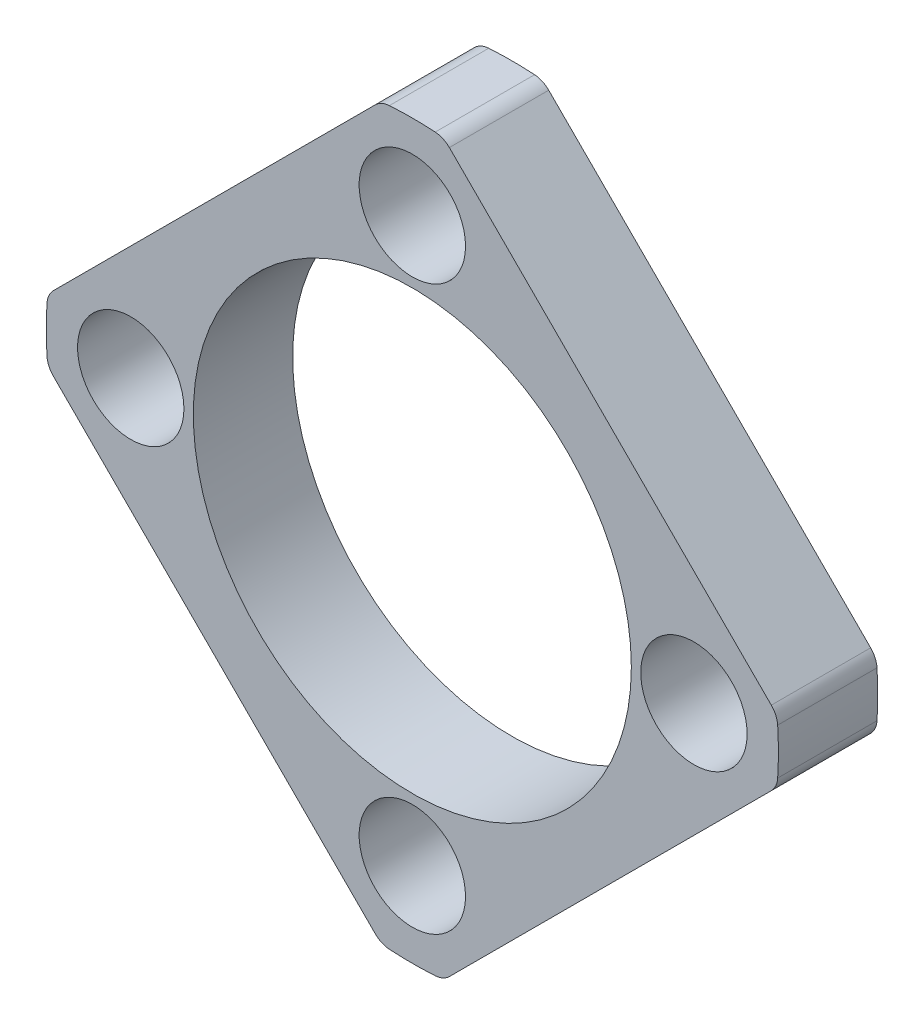
ISO-10303-21;
HEADER;
FILE_DESCRIPTION(('STEP AP214'),'2;1');
FILE_NAME('part.step','',(''),(''),'','','');
FILE_SCHEMA(('AUTOMOTIVE_DESIGN { 1 0 10303 214 1 1 1 1 }'));
ENDSEC;
DATA;
#1=APPLICATION_CONTEXT('core data for automotive mechanical design processes');
#2=APPLICATION_PROTOCOL_DEFINITION('international standard','automotive_design',2000,#1);
#3=PRODUCT_CONTEXT('',#1,'mechanical');
#4=PRODUCT('Part','Part','',(#3));
#5=PRODUCT_RELATED_PRODUCT_CATEGORY('part','',(#4));
#6=PRODUCT_DEFINITION_FORMATION('','',#4);
#7=PRODUCT_DEFINITION_CONTEXT('part definition',#1,'design');
#8=PRODUCT_DEFINITION('design','',#6,#7);
#9=PRODUCT_DEFINITION_SHAPE('','',#8);
#10=(LENGTH_UNIT() NAMED_UNIT(*) SI_UNIT(.MILLI.,.METRE.));
#11=(NAMED_UNIT(*) PLANE_ANGLE_UNIT() SI_UNIT($,.RADIAN.));
#12=(NAMED_UNIT(*) SI_UNIT($,.STERADIAN.) SOLID_ANGLE_UNIT());
#13=UNCERTAINTY_MEASURE_WITH_UNIT(LENGTH_MEASURE(1.E-05),#10,'distance_accuracy_value','');
#14=(GEOMETRIC_REPRESENTATION_CONTEXT(3) GLOBAL_UNCERTAINTY_ASSIGNED_CONTEXT((#13)) GLOBAL_UNIT_ASSIGNED_CONTEXT((#10,
#11,#12)) REPRESENTATION_CONTEXT('',''));
#15=CARTESIAN_POINT('',(0.,0.,0.));
#16=DIRECTION('',(0.,0.,1.));
#17=DIRECTION('',(1.,0.,0.));
#18=AXIS2_PLACEMENT_3D('',#15,#16,#17);
#19=CARTESIAN_POINT('',(-0.688852037974348,10.9784098516032,3.175));
#20=DIRECTION('',(0.,0.,1.));
#21=DIRECTION('',(1.,0.,0.));
#22=AXIS2_PLACEMENT_3D('',#19,#20,#21);
#23=PLANE('',#22);
#24=CARTESIAN_POINT('',(9.00000000000001,0.,3.175));
#25=DIRECTION('',(0.,0.,1.));
#26=DIRECTION('',(1.,0.,0.));
#27=AXIS2_PLACEMENT_3D('',#24,#25,#26);
#28=CIRCLE('',#27,1.7);
#29=CARTESIAN_POINT('',(10.7,0.,3.175));
#30=VERTEX_POINT('',#29);
#31=EDGE_CURVE('E354',#30,#30,#28,.T.);
#32=ORIENTED_EDGE('',*,*,#31,.F.);
#33=EDGE_LOOP('',(#32));
#34=FACE_BOUND('',#33,.T.);
#35=CARTESIAN_POINT('',(-8.99999999999999,0.,3.175));
#36=DIRECTION('',(0.,0.,1.));
#37=DIRECTION('',(1.,0.,0.));
#38=AXIS2_PLACEMENT_3D('',#35,#36,#37);
#39=CIRCLE('',#38,1.7);
#40=CARTESIAN_POINT('',(-7.29999999999999,0.,3.175));
#41=VERTEX_POINT('',#40);
#42=EDGE_CURVE('E366',#41,#41,#39,.T.);
#43=ORIENTED_EDGE('',*,*,#42,.F.);
#44=EDGE_LOOP('',(#43));
#45=FACE_BOUND('',#44,.T.);
#46=CARTESIAN_POINT('',(-0.688852037974348,10.9784098516032,3.175));
#47=DIRECTION('',(0.,0.,1.));
#48=DIRECTION('',(1.,0.,0.));
#49=AXIS2_PLACEMENT_3D('',#46,#47,#48);
#50=CIRCLE('',#49,0.699999999999998);
#51=CARTESIAN_POINT('',(-0.732688076754533,11.6770359330688,3.175));
#52=VERTEX_POINT('',#51);
#53=CARTESIAN_POINT('',(-1.18382678480493,11.4733845984338,3.175));
#54=VERTEX_POINT('',#53);
#55=EDGE_CURVE('E216',#52,#54,#50,.T.);
#56=ORIENTED_EDGE('',*,*,#55,.T.);
#57=DIRECTION('',(-0.707106781186548,-0.707106781186548,0.));
#58=VECTOR('',#57,1.);
#59=CARTESIAN_POINT('',(-1.18382678480493,11.4733845984338,3.175));
#60=LINE('',#59,#58);
#61=CARTESIAN_POINT('',(-11.4733845984338,1.18382678480497,3.175));
#62=VERTEX_POINT('',#61);
#63=EDGE_CURVE('E124',#54,#62,#60,.T.);
#64=ORIENTED_EDGE('',*,*,#63,.T.);
#65=CARTESIAN_POINT('',(-10.978409851603,0.688852037974608,3.175));
#66=DIRECTION('',(0.,0.,1.));
#67=DIRECTION('',(1.,0.,0.));
#68=AXIS2_PLACEMENT_3D('',#65,#66,#67);
#69=CIRCLE('',#68,0.699999999999973);
#70=CARTESIAN_POINT('',(-11.6770359330686,0.732688076754794,3.175));
#71=VERTEX_POINT('',#70);
#72=EDGE_CURVE('E255',#62,#71,#69,.T.);
#73=ORIENTED_EDGE('',*,*,#72,.T.);
#74=CARTESIAN_POINT('',(2.09793120375945E-13,1.96030529048957E-13,3.175));
#75=DIRECTION('',(0.,0.,1.));
#76=DIRECTION('',(1.,0.,0.));
#77=AXIS2_PLACEMENT_3D('',#74,#75,#76);
#78=CIRCLE('',#77,11.7);
#79=CARTESIAN_POINT('',(-11.6770359330686,-0.732688076754352,3.175));
#80=VERTEX_POINT('',#79);
#81=EDGE_CURVE('E274',#71,#80,#78,.T.);
#82=ORIENTED_EDGE('',*,*,#81,.T.);
#83=CARTESIAN_POINT('',(-10.978409851603,-0.688852037974166,3.175));
#84=DIRECTION('',(0.,0.,1.));
#85=DIRECTION('',(1.,0.,0.));
#86=AXIS2_PLACEMENT_3D('',#83,#84,#85);
#87=CIRCLE('',#86,0.700000000000001);
#88=CARTESIAN_POINT('',(-11.4733845984334,-1.18382678480487,3.175));
#89=VERTEX_POINT('',#88);
#90=EDGE_CURVE('E271',#80,#89,#87,.T.);
#91=ORIENTED_EDGE('',*,*,#90,.T.);
#92=DIRECTION('',(0.707106781186547,-0.707106781186547,0.));
#93=VECTOR('',#92,1.);
#94=CARTESIAN_POINT('',(-11.4733845984334,-1.18382678480487,3.175));
#95=LINE('',#94,#93);
#96=CARTESIAN_POINT('',(-1.18382678480462,-11.4733845984337,3.175));
#97=VERTEX_POINT('',#96);
#98=EDGE_CURVE('E273',#89,#97,#95,.T.);
#99=ORIENTED_EDGE('',*,*,#98,.T.);
#100=CARTESIAN_POINT('',(-0.688852037974057,-10.9784098516031,3.175));
#101=DIRECTION('',(0.,0.,1.));
#102=DIRECTION('',(1.,0.,0.));
#103=AXIS2_PLACEMENT_3D('',#100,#101,#102);
#104=CIRCLE('',#103,0.699999999999989);
#105=CARTESIAN_POINT('',(-0.732688076754246,-11.6770359330687,3.175));
#106=VERTEX_POINT('',#105);
#107=EDGE_CURVE('E276',#97,#106,#104,.T.);
#108=ORIENTED_EDGE('',*,*,#107,.T.);
#109=CARTESIAN_POINT('',(3.52799386926783E-13,1.03080521549059E-13,3.175));
#110=DIRECTION('',(0.,0.,1.));
#111=DIRECTION('',(1.,0.,0.));
#112=AXIS2_PLACEMENT_3D('',#109,#110,#111);
#113=CIRCLE('',#112,11.7);
#114=CARTESIAN_POINT('',(0.732688076754891,-11.6770359330687,3.175));
#115=VERTEX_POINT('',#114);
#116=EDGE_CURVE('E282',#106,#115,#113,.T.);
#117=ORIENTED_EDGE('',*,*,#116,.T.);
#118=CARTESIAN_POINT('',(0.688852037974714,-10.9784098516031,3.175));
#119=DIRECTION('',(0.,0.,1.));
#120=DIRECTION('',(1.,0.,0.));
#121=AXIS2_PLACEMENT_3D('',#118,#119,#120);
#122=CIRCLE('',#121,0.700000000000007);
#123=CARTESIAN_POINT('',(1.18382678480554,-11.4733845984334,3.175));
#124=VERTEX_POINT('',#123);
#125=EDGE_CURVE('E284',#115,#124,#122,.T.);
#126=ORIENTED_EDGE('',*,*,#125,.T.);
#127=DIRECTION('',(0.707106781186548,0.707106781186547,0.));
#128=VECTOR('',#127,1.);
#129=CARTESIAN_POINT('',(1.18382678480554,-11.4733845984334,3.175));
#130=LINE('',#129,#128);
#131=CARTESIAN_POINT('',(11.4733845984344,-1.18382678480462,3.175));
#132=VERTEX_POINT('',#131);
#133=EDGE_CURVE('E286',#124,#132,#130,.T.);
#134=ORIENTED_EDGE('',*,*,#133,.T.);
#135=CARTESIAN_POINT('',(10.9784098516038,-0.688852037974074,3.175));
#136=DIRECTION('',(0.,0.,1.));
#137=DIRECTION('',(1.,0.,0.));
#138=AXIS2_PLACEMENT_3D('',#135,#136,#137);
#139=CIRCLE('',#138,0.699999999999958);
#140=CARTESIAN_POINT('',(11.6770359330694,-0.732688076754231,3.175));
#141=VERTEX_POINT('',#140);
#142=EDGE_CURVE('E288',#132,#141,#139,.T.);
#143=ORIENTED_EDGE('',*,*,#142,.T.);
#144=CARTESIAN_POINT('',(5.90902417543838E-13,3.71528485224192E-13,3.175));
#145=DIRECTION('',(0.,0.,1.));
#146=DIRECTION('',(1.,0.,0.));
#147=AXIS2_PLACEMENT_3D('',#144,#145,#146);
#148=CIRCLE('',#147,11.6999999999999);
#149=CARTESIAN_POINT('',(11.6770359330694,0.732688076754931,3.175));
#150=VERTEX_POINT('',#149);
#151=EDGE_CURVE('E290',#141,#150,#148,.T.);
#152=ORIENTED_EDGE('',*,*,#151,.T.);
#153=CARTESIAN_POINT('',(10.9784098516038,0.688852037973795,3.175));
#154=DIRECTION('',(0.,0.,1.));
#155=DIRECTION('',(1.,0.,0.));
#156=AXIS2_PLACEMENT_3D('',#153,#154,#155);
#157=CIRCLE('',#156,0.699999999999996);
#158=CARTESIAN_POINT('',(11.4733845984338,1.18382678480496,3.175));
#159=VERTEX_POINT('',#158);
#160=EDGE_CURVE('E167',#150,#159,#157,.T.);
#161=ORIENTED_EDGE('',*,*,#160,.T.);
#162=DIRECTION('',(-0.707106781186547,0.707106781186548,0.));
#163=VECTOR('',#162,1.);
#164=CARTESIAN_POINT('',(11.4733845984338,1.18382678480496,3.175));
#165=LINE('',#164,#163);
#166=CARTESIAN_POINT('',(1.183826784805,11.4733845984338,3.175));
#167=VERTEX_POINT('',#166);
#168=EDGE_CURVE('E161',#159,#167,#165,.T.);
#169=ORIENTED_EDGE('',*,*,#168,.T.);
#170=CARTESIAN_POINT('',(0.688852037974424,10.9784098516032,3.175));
#171=DIRECTION('',(0.,0.,1.));
#172=DIRECTION('',(1.,0.,0.));
#173=AXIS2_PLACEMENT_3D('',#170,#171,#172);
#174=CIRCLE('',#173,0.69999999999999);
#175=CARTESIAN_POINT('',(0.732688076754614,11.6770359330688,3.175));
#176=VERTEX_POINT('',#175);
#177=EDGE_CURVE('E165',#167,#176,#174,.T.);
#178=ORIENTED_EDGE('',*,*,#177,.T.);
#179=CARTESIAN_POINT('',(0.,0.,3.175));
#180=DIRECTION('',(0.,0.,1.));
#181=DIRECTION('',(1.,0.,0.));
#182=AXIS2_PLACEMENT_3D('',#179,#180,#181);
#183=CIRCLE('',#182,11.7);
#184=EDGE_CURVE('E57',#176,#52,#183,.T.);
#185=ORIENTED_EDGE('',*,*,#184,.T.);
#186=EDGE_LOOP('',(#56,#64,#73,#82,#91,#99,#108,#117,#126,#134,#143,#152,#161,#169,#178,#185));
#187=FACE_BOUND('',#186,.T.);
#188=CARTESIAN_POINT('',(0.,-9.,3.175));
#189=DIRECTION('',(0.,0.,1.));
#190=DIRECTION('',(1.,0.,0.));
#191=AXIS2_PLACEMENT_3D('',#188,#189,#190);
#192=CIRCLE('',#191,1.7);
#193=CARTESIAN_POINT('',(1.70000000000002,-9.,3.175));
#194=VERTEX_POINT('',#193);
#195=EDGE_CURVE('E189',#194,#194,#192,.T.);
#196=ORIENTED_EDGE('',*,*,#195,.F.);
#197=EDGE_LOOP('',(#196));
#198=FACE_BOUND('',#197,.T.);
#199=CARTESIAN_POINT('',(0.,9.,3.175));
#200=DIRECTION('',(0.,0.,1.));
#201=DIRECTION('',(1.,0.,0.));
#202=AXIS2_PLACEMENT_3D('',#199,#200,#201);
#203=CIRCLE('',#202,1.7);
#204=CARTESIAN_POINT('',(1.70000000000001,9.,3.175));
#205=VERTEX_POINT('',#204);
#206=EDGE_CURVE('E360',#205,#205,#203,.T.);
#207=ORIENTED_EDGE('',*,*,#206,.F.);
#208=EDGE_LOOP('',(#207));
#209=FACE_BOUND('',#208,.T.);
#210=CARTESIAN_POINT('',(2.09793120375945E-13,1.96030529048957E-13,3.175));
#211=DIRECTION('',(0.,0.,1.));
#212=DIRECTION('',(1.,0.,0.));
#213=AXIS2_PLACEMENT_3D('',#210,#211,#212);
#214=CIRCLE('',#213,6.99999999999975);
#215=CARTESIAN_POINT('',(6.99999999999996,1.96030529048957E-13,3.175));
#216=VERTEX_POINT('',#215);
#217=EDGE_CURVE('E345',#216,#216,#214,.T.);
#218=ORIENTED_EDGE('',*,*,#217,.F.);
#219=EDGE_LOOP('',(#218));
#220=FACE_BOUND('',#219,.T.);
#221=ADVANCED_FACE('F40',(#34,#45,#187,#198,#209,#220),#23,.T.);
#222=CARTESIAN_POINT('',(-0.688852037974348,10.9784098516032,0.));
#223=DIRECTION('',(0.,0.,1.));
#224=DIRECTION('',(1.,0.,0.));
#225=AXIS2_PLACEMENT_3D('',#222,#223,#224);
#226=PLANE('',#225);
#227=CARTESIAN_POINT('',(-0.688852037974348,10.9784098516032,0.));
#228=DIRECTION('',(0.,0.,1.));
#229=DIRECTION('',(1.,0.,0.));
#230=AXIS2_PLACEMENT_3D('',#227,#228,#229);
#231=CIRCLE('',#230,0.699999999999998);
#232=CARTESIAN_POINT('',(-0.732688076754533,11.6770359330688,0.));
#233=VERTEX_POINT('',#232);
#234=CARTESIAN_POINT('',(-1.18382678480493,11.4733845984338,0.));
#235=VERTEX_POINT('',#234);
#236=EDGE_CURVE('E185',#233,#235,#231,.T.);
#237=ORIENTED_EDGE('',*,*,#236,.F.);
#238=CARTESIAN_POINT('',(0.,0.,0.));
#239=DIRECTION('',(0.,0.,1.));
#240=DIRECTION('',(1.,0.,0.));
#241=AXIS2_PLACEMENT_3D('',#238,#239,#240);
#242=CIRCLE('',#241,11.7);
#243=CARTESIAN_POINT('',(0.732688076754614,11.6770359330688,0.));
#244=VERTEX_POINT('',#243);
#245=EDGE_CURVE('E116',#244,#233,#242,.T.);
#246=ORIENTED_EDGE('',*,*,#245,.F.);
#247=CARTESIAN_POINT('',(0.688852037974424,10.9784098516032,0.));
#248=DIRECTION('',(0.,0.,1.));
#249=DIRECTION('',(1.,0.,0.));
#250=AXIS2_PLACEMENT_3D('',#247,#248,#249);
#251=CIRCLE('',#250,0.69999999999999);
#252=CARTESIAN_POINT('',(1.183826784805,11.4733845984338,0.));
#253=VERTEX_POINT('',#252);
#254=EDGE_CURVE('E110',#253,#244,#251,.T.);
#255=ORIENTED_EDGE('',*,*,#254,.F.);
#256=DIRECTION('',(-0.707106781186547,0.707106781186548,0.));
#257=VECTOR('',#256,1.);
#258=CARTESIAN_POINT('',(11.4733845984338,1.18382678480496,0.));
#259=LINE('',#258,#257);
#260=CARTESIAN_POINT('',(11.4733845984338,1.18382678480496,0.));
#261=VERTEX_POINT('',#260);
#262=EDGE_CURVE('E175',#261,#253,#259,.T.);
#263=ORIENTED_EDGE('',*,*,#262,.F.);
#264=CARTESIAN_POINT('',(10.9784098516038,0.688852037973795,0.));
#265=DIRECTION('',(0.,0.,1.));
#266=DIRECTION('',(1.,0.,0.));
#267=AXIS2_PLACEMENT_3D('',#264,#265,#266);
#268=CIRCLE('',#267,0.699999999999996);
#269=CARTESIAN_POINT('',(11.6770359330694,0.732688076754931,0.));
#270=VERTEX_POINT('',#269);
#271=EDGE_CURVE('E211',#270,#261,#268,.T.);
#272=ORIENTED_EDGE('',*,*,#271,.F.);
#273=CARTESIAN_POINT('',(5.90902417543838E-13,3.71528485224192E-13,0.));
#274=DIRECTION('',(0.,0.,1.));
#275=DIRECTION('',(1.,0.,0.));
#276=AXIS2_PLACEMENT_3D('',#273,#274,#275);
#277=CIRCLE('',#276,11.6999999999999);
#278=CARTESIAN_POINT('',(11.6770359330694,-0.732688076754231,0.));
#279=VERTEX_POINT('',#278);
#280=EDGE_CURVE('E209',#279,#270,#277,.T.);
#281=ORIENTED_EDGE('',*,*,#280,.F.);
#282=CARTESIAN_POINT('',(10.9784098516038,-0.688852037974074,0.));
#283=DIRECTION('',(0.,0.,1.));
#284=DIRECTION('',(1.,0.,0.));
#285=AXIS2_PLACEMENT_3D('',#282,#283,#284);
#286=CIRCLE('',#285,0.699999999999958);
#287=CARTESIAN_POINT('',(11.4733845984344,-1.18382678480462,0.));
#288=VERTEX_POINT('',#287);
#289=EDGE_CURVE('E207',#288,#279,#286,.T.);
#290=ORIENTED_EDGE('',*,*,#289,.F.);
#291=DIRECTION('',(0.707106781186548,0.707106781186547,0.));
#292=VECTOR('',#291,1.);
#293=CARTESIAN_POINT('',(1.18382678480554,-11.4733845984334,0.));
#294=LINE('',#293,#292);
#295=CARTESIAN_POINT('',(1.18382678480554,-11.4733845984334,0.));
#296=VERTEX_POINT('',#295);
#297=EDGE_CURVE('E205',#296,#288,#294,.T.);
#298=ORIENTED_EDGE('',*,*,#297,.F.);
#299=CARTESIAN_POINT('',(0.688852037974714,-10.9784098516031,0.));
#300=DIRECTION('',(0.,0.,1.));
#301=DIRECTION('',(1.,0.,0.));
#302=AXIS2_PLACEMENT_3D('',#299,#300,#301);
#303=CIRCLE('',#302,0.700000000000007);
#304=CARTESIAN_POINT('',(0.732688076754891,-11.6770359330687,0.));
#305=VERTEX_POINT('',#304);
#306=EDGE_CURVE('E203',#305,#296,#303,.T.);
#307=ORIENTED_EDGE('',*,*,#306,.F.);
#308=CARTESIAN_POINT('',(3.52799386926783E-13,1.03080521549059E-13,0.));
#309=DIRECTION('',(0.,0.,1.));
#310=DIRECTION('',(1.,0.,0.));
#311=AXIS2_PLACEMENT_3D('',#308,#309,#310);
#312=CIRCLE('',#311,11.7);
#313=CARTESIAN_POINT('',(-0.732688076754246,-11.6770359330687,0.));
#314=VERTEX_POINT('',#313);
#315=EDGE_CURVE('E201',#314,#305,#312,.T.);
#316=ORIENTED_EDGE('',*,*,#315,.F.);
#317=CARTESIAN_POINT('',(-0.688852037974057,-10.9784098516031,0.));
#318=DIRECTION('',(0.,0.,1.));
#319=DIRECTION('',(1.,0.,0.));
#320=AXIS2_PLACEMENT_3D('',#317,#318,#319);
#321=CIRCLE('',#320,0.699999999999989);
#322=CARTESIAN_POINT('',(-1.18382678480462,-11.4733845984337,0.));
#323=VERTEX_POINT('',#322);
#324=EDGE_CURVE('E199',#323,#314,#321,.T.);
#325=ORIENTED_EDGE('',*,*,#324,.F.);
#326=DIRECTION('',(0.707106781186547,-0.707106781186547,0.));
#327=VECTOR('',#326,1.);
#328=CARTESIAN_POINT('',(-11.4733845984334,-1.18382678480487,0.));
#329=LINE('',#328,#327);
#330=CARTESIAN_POINT('',(-11.4733845984334,-1.18382678480487,0.));
#331=VERTEX_POINT('',#330);
#332=EDGE_CURVE('E197',#331,#323,#329,.T.);
#333=ORIENTED_EDGE('',*,*,#332,.F.);
#334=CARTESIAN_POINT('',(-10.978409851603,-0.688852037974166,0.));
#335=DIRECTION('',(0.,0.,1.));
#336=DIRECTION('',(1.,0.,0.));
#337=AXIS2_PLACEMENT_3D('',#334,#335,#336);
#338=CIRCLE('',#337,0.700000000000001);
#339=CARTESIAN_POINT('',(-11.6770359330686,-0.732688076754352,0.));
#340=VERTEX_POINT('',#339);
#341=EDGE_CURVE('E195',#340,#331,#338,.T.);
#342=ORIENTED_EDGE('',*,*,#341,.F.);
#343=CARTESIAN_POINT('',(2.09793120375945E-13,1.96030529048957E-13,0.));
#344=DIRECTION('',(0.,0.,1.));
#345=DIRECTION('',(1.,0.,0.));
#346=AXIS2_PLACEMENT_3D('',#343,#344,#345);
#347=CIRCLE('',#346,11.7);
#348=CARTESIAN_POINT('',(-11.6770359330686,0.732688076754794,0.));
#349=VERTEX_POINT('',#348);
#350=EDGE_CURVE('E193',#349,#340,#347,.T.);
#351=ORIENTED_EDGE('',*,*,#350,.F.);
#352=CARTESIAN_POINT('',(-10.978409851603,0.688852037974608,0.));
#353=DIRECTION('',(0.,0.,1.));
#354=DIRECTION('',(1.,0.,0.));
#355=AXIS2_PLACEMENT_3D('',#352,#353,#354);
#356=CIRCLE('',#355,0.699999999999973);
#357=CARTESIAN_POINT('',(-11.4733845984338,1.18382678480497,0.));
#358=VERTEX_POINT('',#357);
#359=EDGE_CURVE('E191',#358,#349,#356,.T.);
#360=ORIENTED_EDGE('',*,*,#359,.F.);
#361=DIRECTION('',(-0.707106781186548,-0.707106781186548,0.));
#362=VECTOR('',#361,1.);
#363=CARTESIAN_POINT('',(-1.18382678480493,11.4733845984338,0.));
#364=LINE('',#363,#362);
#365=EDGE_CURVE('E188',#235,#358,#364,.T.);
#366=ORIENTED_EDGE('',*,*,#365,.F.);
#367=EDGE_LOOP('',(#237,#246,#255,#263,#272,#281,#290,#298,#307,#316,#325,#333,#342,#351,#360,#366));
#368=FACE_BOUND('',#367,.T.);
#369=CARTESIAN_POINT('',(0.,-9.,0.));
#370=DIRECTION('',(0.,0.,1.));
#371=DIRECTION('',(1.,0.,0.));
#372=AXIS2_PLACEMENT_3D('',#369,#370,#371);
#373=CIRCLE('',#372,1.7);
#374=CARTESIAN_POINT('',(1.70000000000002,-9.,0.));
#375=VERTEX_POINT('',#374);
#376=EDGE_CURVE('E369',#375,#375,#373,.T.);
#377=ORIENTED_EDGE('',*,*,#376,.T.);
#378=EDGE_LOOP('',(#377));
#379=FACE_BOUND('',#378,.T.);
#380=CARTESIAN_POINT('',(-8.99999999999999,0.,0.));
#381=DIRECTION('',(0.,0.,1.));
#382=DIRECTION('',(1.,0.,0.));
#383=AXIS2_PLACEMENT_3D('',#380,#381,#382);
#384=CIRCLE('',#383,1.7);
#385=CARTESIAN_POINT('',(-7.29999999999999,0.,0.));
#386=VERTEX_POINT('',#385);
#387=EDGE_CURVE('E363',#386,#386,#384,.T.);
#388=ORIENTED_EDGE('',*,*,#387,.T.);
#389=EDGE_LOOP('',(#388));
#390=FACE_BOUND('',#389,.T.);
#391=CARTESIAN_POINT('',(0.,9.,0.));
#392=DIRECTION('',(0.,0.,1.));
#393=DIRECTION('',(1.,0.,0.));
#394=AXIS2_PLACEMENT_3D('',#391,#392,#393);
#395=CIRCLE('',#394,1.7);
#396=CARTESIAN_POINT('',(1.70000000000001,9.,0.));
#397=VERTEX_POINT('',#396);
#398=EDGE_CURVE('E357',#397,#397,#395,.T.);
#399=ORIENTED_EDGE('',*,*,#398,.T.);
#400=EDGE_LOOP('',(#399));
#401=FACE_BOUND('',#400,.T.);
#402=CARTESIAN_POINT('',(9.00000000000001,0.,0.));
#403=DIRECTION('',(0.,0.,1.));
#404=DIRECTION('',(1.,0.,0.));
#405=AXIS2_PLACEMENT_3D('',#402,#403,#404);
#406=CIRCLE('',#405,1.7);
#407=CARTESIAN_POINT('',(10.7,0.,0.));
#408=VERTEX_POINT('',#407);
#409=EDGE_CURVE('E351',#408,#408,#406,.T.);
#410=ORIENTED_EDGE('',*,*,#409,.T.);
#411=EDGE_LOOP('',(#410));
#412=FACE_BOUND('',#411,.T.);
#413=CARTESIAN_POINT('',(2.09793120375945E-13,1.96030529048957E-13,0.));
#414=DIRECTION('',(0.,0.,1.));
#415=DIRECTION('',(1.,0.,0.));
#416=AXIS2_PLACEMENT_3D('',#413,#414,#415);
#417=CIRCLE('',#416,6.99999999999975);
#418=CARTESIAN_POINT('',(6.99999999999996,1.96030529048957E-13,0.));
#419=VERTEX_POINT('',#418);
#420=EDGE_CURVE('E348',#419,#419,#417,.T.);
#421=ORIENTED_EDGE('',*,*,#420,.T.);
#422=EDGE_LOOP('',(#421));
#423=FACE_BOUND('',#422,.T.);
#424=ADVANCED_FACE('F259',(#368,#379,#390,#401,#412,#423),#226,.F.);
#425=CARTESIAN_POINT('',(-0.688852037974348,10.9784098516032,3.175));
#426=DIRECTION('',(0.,0.,-1.));
#427=DIRECTION('',(-1.,0.,0.));
#428=AXIS2_PLACEMENT_3D('',#425,#426,#427);
#429=CYLINDRICAL_SURFACE('',#428,0.699999999999998);
#430=ORIENTED_EDGE('',*,*,#236,.T.);
#431=DIRECTION('',(0.,0.,-1.));
#432=VECTOR('',#431,1.);
#433=CARTESIAN_POINT('',(-1.18382678480493,11.4733845984338,3.175));
#434=LINE('',#433,#432);
#435=EDGE_CURVE('E11',#54,#235,#434,.T.);
#436=ORIENTED_EDGE('',*,*,#435,.F.);
#437=ORIENTED_EDGE('',*,*,#55,.F.);
#438=DIRECTION('',(0.,0.,-1.));
#439=VECTOR('',#438,1.);
#440=CARTESIAN_POINT('',(-0.732688076754533,11.6770359330688,3.175));
#441=LINE('',#440,#439);
#442=EDGE_CURVE('E181',#52,#233,#441,.T.);
#443=ORIENTED_EDGE('',*,*,#442,.T.);
#444=EDGE_LOOP('',(#430,#436,#437,#443));
#445=FACE_BOUND('',#444,.T.);
#446=ADVANCED_FACE('F42',(#445),#429,.T.);
#447=CARTESIAN_POINT('',(-1.18382678480493,11.4733845984338,3.175));
#448=DIRECTION('',(0.707106781186548,-0.707106781186548,0.));
#449=DIRECTION('',(0.707106781186548,0.707106781186548,0.));
#450=AXIS2_PLACEMENT_3D('',#447,#448,#449);
#451=PLANE('',#450);
#452=ORIENTED_EDGE('',*,*,#365,.T.);
#453=DIRECTION('',(0.,0.,-1.));
#454=VECTOR('',#453,1.);
#455=CARTESIAN_POINT('',(-11.4733845984338,1.18382678480497,3.175));
#456=LINE('',#455,#454);
#457=EDGE_CURVE('E49',#62,#358,#456,.T.);
#458=ORIENTED_EDGE('',*,*,#457,.F.);
#459=ORIENTED_EDGE('',*,*,#63,.F.);
#460=ORIENTED_EDGE('',*,*,#435,.T.);
#461=EDGE_LOOP('',(#452,#458,#459,#460));
#462=FACE_BOUND('',#461,.T.);
#463=ADVANCED_FACE('F542',(#462),#451,.F.);
#464=CARTESIAN_POINT('',(-10.978409851603,0.688852037974608,3.175));
#465=DIRECTION('',(0.,0.,-1.));
#466=DIRECTION('',(-1.,0.,0.));
#467=AXIS2_PLACEMENT_3D('',#464,#465,#466);
#468=CYLINDRICAL_SURFACE('',#467,0.699999999999973);
#469=ORIENTED_EDGE('',*,*,#359,.T.);
#470=DIRECTION('',(0.,0.,-1.));
#471=VECTOR('',#470,1.);
#472=CARTESIAN_POINT('',(-11.6770359330686,0.732688076754794,3.175));
#473=LINE('',#472,#471);
#474=EDGE_CURVE('E247',#71,#349,#473,.T.);
#475=ORIENTED_EDGE('',*,*,#474,.F.);
#476=ORIENTED_EDGE('',*,*,#72,.F.);
#477=ORIENTED_EDGE('',*,*,#457,.T.);
#478=EDGE_LOOP('',(#469,#475,#476,#477));
#479=FACE_BOUND('',#478,.T.);
#480=ADVANCED_FACE('F253',(#479),#468,.T.);
#481=CARTESIAN_POINT('',(2.09793120375945E-13,1.96030529048957E-13,3.175));
#482=DIRECTION('',(0.,0.,-1.));
#483=DIRECTION('',(-1.,0.,0.));
#484=AXIS2_PLACEMENT_3D('',#481,#482,#483);
#485=CYLINDRICAL_SURFACE('',#484,11.7);
#486=ORIENTED_EDGE('',*,*,#350,.T.);
#487=DIRECTION('',(0.,0.,-1.));
#488=VECTOR('',#487,1.);
#489=CARTESIAN_POINT('',(-11.6770359330686,-0.732688076754352,3.175));
#490=LINE('',#489,#488);
#491=EDGE_CURVE('E244',#80,#340,#490,.T.);
#492=ORIENTED_EDGE('',*,*,#491,.F.);
#493=ORIENTED_EDGE('',*,*,#81,.F.);
#494=ORIENTED_EDGE('',*,*,#474,.T.);
#495=EDGE_LOOP('',(#486,#492,#493,#494));
#496=FACE_BOUND('',#495,.T.);
#497=ADVANCED_FACE('F265',(#496),#485,.T.);
#498=CARTESIAN_POINT('',(-10.978409851603,-0.688852037974166,3.175));
#499=DIRECTION('',(0.,0.,-1.));
#500=DIRECTION('',(-1.,0.,0.));
#501=AXIS2_PLACEMENT_3D('',#498,#499,#500);
#502=CYLINDRICAL_SURFACE('',#501,0.700000000000001);
#503=ORIENTED_EDGE('',*,*,#341,.T.);
#504=DIRECTION('',(0.,0.,-1.));
#505=VECTOR('',#504,1.);
#506=CARTESIAN_POINT('',(-11.4733845984334,-1.18382678480487,3.175));
#507=LINE('',#506,#505);
#508=EDGE_CURVE('E241',#89,#331,#507,.T.);
#509=ORIENTED_EDGE('',*,*,#508,.F.);
#510=ORIENTED_EDGE('',*,*,#90,.F.);
#511=ORIENTED_EDGE('',*,*,#491,.T.);
#512=EDGE_LOOP('',(#503,#509,#510,#511));
#513=FACE_BOUND('',#512,.T.);
#514=ADVANCED_FACE('F269',(#513),#502,.T.);
#515=CARTESIAN_POINT('',(-11.4733845984334,-1.18382678480487,3.175));
#516=DIRECTION('',(0.707106781186548,0.707106781186548,0.));
#517=DIRECTION('',(-0.707106781186548,0.707106781186548,0.));
#518=AXIS2_PLACEMENT_3D('',#515,#516,#517);
#519=PLANE('',#518);
#520=ORIENTED_EDGE('',*,*,#332,.T.);
#521=DIRECTION('',(0.,0.,-1.));
#522=VECTOR('',#521,1.);
#523=CARTESIAN_POINT('',(-1.18382678480462,-11.4733845984337,3.175));
#524=LINE('',#523,#522);
#525=EDGE_CURVE('E238',#97,#323,#524,.T.);
#526=ORIENTED_EDGE('',*,*,#525,.F.);
#527=ORIENTED_EDGE('',*,*,#98,.F.);
#528=ORIENTED_EDGE('',*,*,#508,.T.);
#529=EDGE_LOOP('',(#520,#526,#527,#528));
#530=FACE_BOUND('',#529,.T.);
#531=ADVANCED_FACE('F503',(#530),#519,.F.);
#532=CARTESIAN_POINT('',(-0.688852037974057,-10.9784098516031,3.175));
#533=DIRECTION('',(0.,0.,-1.));
#534=DIRECTION('',(-1.,0.,0.));
#535=AXIS2_PLACEMENT_3D('',#532,#533,#534);
#536=CYLINDRICAL_SURFACE('',#535,0.699999999999989);
#537=ORIENTED_EDGE('',*,*,#324,.T.);
#538=DIRECTION('',(0.,0.,-1.));
#539=VECTOR('',#538,1.);
#540=CARTESIAN_POINT('',(-0.732688076754246,-11.6770359330687,3.175));
#541=LINE('',#540,#539);
#542=EDGE_CURVE('E235',#106,#314,#541,.T.);
#543=ORIENTED_EDGE('',*,*,#542,.F.);
#544=ORIENTED_EDGE('',*,*,#107,.F.);
#545=ORIENTED_EDGE('',*,*,#525,.T.);
#546=EDGE_LOOP('',(#537,#543,#544,#545));
#547=FACE_BOUND('',#546,.T.);
#548=ADVANCED_FACE('F492',(#547),#536,.T.);
#549=CARTESIAN_POINT('',(3.52799386926783E-13,1.03080521549059E-13,3.175));
#550=DIRECTION('',(0.,0.,-1.));
#551=DIRECTION('',(-1.,0.,0.));
#552=AXIS2_PLACEMENT_3D('',#549,#550,#551);
#553=CYLINDRICAL_SURFACE('',#552,11.7);
#554=ORIENTED_EDGE('',*,*,#315,.T.);
#555=DIRECTION('',(0.,0.,-1.));
#556=VECTOR('',#555,1.);
#557=CARTESIAN_POINT('',(0.732688076754891,-11.6770359330687,3.175));
#558=LINE('',#557,#556);
#559=EDGE_CURVE('E232',#115,#305,#558,.T.);
#560=ORIENTED_EDGE('',*,*,#559,.F.);
#561=ORIENTED_EDGE('',*,*,#116,.F.);
#562=ORIENTED_EDGE('',*,*,#542,.T.);
#563=EDGE_LOOP('',(#554,#560,#561,#562));
#564=FACE_BOUND('',#563,.T.);
#565=ADVANCED_FACE('F481',(#564),#553,.T.);
#566=CARTESIAN_POINT('',(0.688852037974714,-10.9784098516031,3.175));
#567=DIRECTION('',(0.,0.,-1.));
#568=DIRECTION('',(-1.,0.,0.));
#569=AXIS2_PLACEMENT_3D('',#566,#567,#568);
#570=CYLINDRICAL_SURFACE('',#569,0.700000000000007);
#571=ORIENTED_EDGE('',*,*,#306,.T.);
#572=DIRECTION('',(0.,0.,-1.));
#573=VECTOR('',#572,1.);
#574=CARTESIAN_POINT('',(1.18382678480554,-11.4733845984334,3.175));
#575=LINE('',#574,#573);
#576=EDGE_CURVE('E229',#124,#296,#575,.T.);
#577=ORIENTED_EDGE('',*,*,#576,.F.);
#578=ORIENTED_EDGE('',*,*,#125,.F.);
#579=ORIENTED_EDGE('',*,*,#559,.T.);
#580=EDGE_LOOP('',(#571,#577,#578,#579));
#581=FACE_BOUND('',#580,.T.);
#582=ADVANCED_FACE('F470',(#581),#570,.T.);
#583=CARTESIAN_POINT('',(1.18382678480554,-11.4733845984334,3.175));
#584=DIRECTION('',(-0.707106781186547,0.707106781186548,0.));
#585=DIRECTION('',(-0.707106781186548,-0.707106781186547,0.));
#586=AXIS2_PLACEMENT_3D('',#583,#584,#585);
#587=PLANE('',#586);
#588=ORIENTED_EDGE('',*,*,#297,.T.);
#589=DIRECTION('',(0.,0.,-1.));
#590=VECTOR('',#589,1.);
#591=CARTESIAN_POINT('',(11.4733845984344,-1.18382678480462,3.175));
#592=LINE('',#591,#590);
#593=EDGE_CURVE('E226',#132,#288,#592,.T.);
#594=ORIENTED_EDGE('',*,*,#593,.F.);
#595=ORIENTED_EDGE('',*,*,#133,.F.);
#596=ORIENTED_EDGE('',*,*,#576,.T.);
#597=EDGE_LOOP('',(#588,#594,#595,#596));
#598=FACE_BOUND('',#597,.T.);
#599=ADVANCED_FACE('F459',(#598),#587,.F.);
#600=CARTESIAN_POINT('',(10.9784098516038,-0.688852037974074,3.175));
#601=DIRECTION('',(0.,0.,-1.));
#602=DIRECTION('',(-1.,0.,0.));
#603=AXIS2_PLACEMENT_3D('',#600,#601,#602);
#604=CYLINDRICAL_SURFACE('',#603,0.699999999999958);
#605=ORIENTED_EDGE('',*,*,#289,.T.);
#606=DIRECTION('',(0.,0.,-1.));
#607=VECTOR('',#606,1.);
#608=CARTESIAN_POINT('',(11.6770359330694,-0.732688076754231,3.175));
#609=LINE('',#608,#607);
#610=EDGE_CURVE('E223',#141,#279,#609,.T.);
#611=ORIENTED_EDGE('',*,*,#610,.F.);
#612=ORIENTED_EDGE('',*,*,#142,.F.);
#613=ORIENTED_EDGE('',*,*,#593,.T.);
#614=EDGE_LOOP('',(#605,#611,#612,#613));
#615=FACE_BOUND('',#614,.T.);
#616=ADVANCED_FACE('F449',(#615),#604,.T.);
#617=CARTESIAN_POINT('',(5.90902417543838E-13,3.71528485224192E-13,3.175));
#618=DIRECTION('',(0.,0.,-1.));
#619=DIRECTION('',(-1.,0.,0.));
#620=AXIS2_PLACEMENT_3D('',#617,#618,#619);
#621=CYLINDRICAL_SURFACE('',#620,11.6999999999999);
#622=ORIENTED_EDGE('',*,*,#280,.T.);
#623=DIRECTION('',(0.,0.,-1.));
#624=VECTOR('',#623,1.);
#625=CARTESIAN_POINT('',(11.6770359330694,0.732688076754931,3.175));
#626=LINE('',#625,#624);
#627=EDGE_CURVE('E220',#150,#270,#626,.T.);
#628=ORIENTED_EDGE('',*,*,#627,.F.);
#629=ORIENTED_EDGE('',*,*,#151,.F.);
#630=ORIENTED_EDGE('',*,*,#610,.T.);
#631=EDGE_LOOP('',(#622,#628,#629,#630));
#632=FACE_BOUND('',#631,.T.);
#633=ADVANCED_FACE('F296',(#632),#621,.T.);
#634=CARTESIAN_POINT('',(10.9784098516038,0.688852037973795,3.175));
#635=DIRECTION('',(0.,0.,-1.));
#636=DIRECTION('',(-1.,0.,0.));
#637=AXIS2_PLACEMENT_3D('',#634,#635,#636);
#638=CYLINDRICAL_SURFACE('',#637,0.699999999999996);
#639=ORIENTED_EDGE('',*,*,#271,.T.);
#640=DIRECTION('',(0.,0.,-1.));
#641=VECTOR('',#640,1.);
#642=CARTESIAN_POINT('',(11.4733845984338,1.18382678480496,3.175));
#643=LINE('',#642,#641);
#644=EDGE_CURVE('E176',#159,#261,#643,.T.);
#645=ORIENTED_EDGE('',*,*,#644,.F.);
#646=ORIENTED_EDGE('',*,*,#160,.F.);
#647=ORIENTED_EDGE('',*,*,#627,.T.);
#648=EDGE_LOOP('',(#639,#645,#646,#647));
#649=FACE_BOUND('',#648,.T.);
#650=ADVANCED_FACE('F300',(#649),#638,.T.);
#651=CARTESIAN_POINT('',(11.4733845984338,1.18382678480496,3.175));
#652=DIRECTION('',(-0.707106781186548,-0.707106781186547,0.));
#653=DIRECTION('',(0.707106781186547,-0.707106781186548,0.));
#654=AXIS2_PLACEMENT_3D('',#651,#652,#653);
#655=PLANE('',#654);
#656=ORIENTED_EDGE('',*,*,#262,.T.);
#657=DIRECTION('',(0.,0.,-1.));
#658=VECTOR('',#657,1.);
#659=CARTESIAN_POINT('',(1.183826784805,11.4733845984338,3.175));
#660=LINE('',#659,#658);
#661=EDGE_CURVE('E172',#167,#253,#660,.T.);
#662=ORIENTED_EDGE('',*,*,#661,.F.);
#663=ORIENTED_EDGE('',*,*,#168,.F.);
#664=ORIENTED_EDGE('',*,*,#644,.T.);
#665=EDGE_LOOP('',(#656,#662,#663,#664));
#666=FACE_BOUND('',#665,.T.);
#667=ADVANCED_FACE('F173',(#666),#655,.F.);
#668=CARTESIAN_POINT('',(0.688852037974424,10.9784098516032,3.175));
#669=DIRECTION('',(0.,0.,-1.));
#670=DIRECTION('',(-1.,0.,0.));
#671=AXIS2_PLACEMENT_3D('',#668,#669,#670);
#672=CYLINDRICAL_SURFACE('',#671,0.69999999999999);
#673=ORIENTED_EDGE('',*,*,#254,.T.);
#674=DIRECTION('',(0.,0.,-1.));
#675=VECTOR('',#674,1.);
#676=CARTESIAN_POINT('',(0.732688076754614,11.6770359330688,3.175));
#677=LINE('',#676,#675);
#678=EDGE_CURVE('E177',#176,#244,#677,.T.);
#679=ORIENTED_EDGE('',*,*,#678,.F.);
#680=ORIENTED_EDGE('',*,*,#177,.F.);
#681=ORIENTED_EDGE('',*,*,#661,.T.);
#682=EDGE_LOOP('',(#673,#679,#680,#681));
#683=FACE_BOUND('',#682,.T.);
#684=ADVANCED_FACE('F179',(#683),#672,.T.);
#685=CARTESIAN_POINT('',(0.,0.,3.175));
#686=DIRECTION('',(0.,0.,-1.));
#687=DIRECTION('',(-1.,0.,0.));
#688=AXIS2_PLACEMENT_3D('',#685,#686,#687);
#689=CYLINDRICAL_SURFACE('',#688,11.7);
#690=ORIENTED_EDGE('',*,*,#245,.T.);
#691=ORIENTED_EDGE('',*,*,#442,.F.);
#692=ORIENTED_EDGE('',*,*,#184,.F.);
#693=ORIENTED_EDGE('',*,*,#678,.T.);
#694=EDGE_LOOP('',(#690,#691,#692,#693));
#695=FACE_BOUND('',#694,.T.);
#696=ADVANCED_FACE('F304',(#695),#689,.T.);
#697=CARTESIAN_POINT('',(0.,-9.,3.175));
#698=DIRECTION('',(0.,0.,-1.));
#699=DIRECTION('',(-1.,0.,0.));
#700=AXIS2_PLACEMENT_3D('',#697,#698,#699);
#701=CYLINDRICAL_SURFACE('',#700,1.7);
#702=ORIENTED_EDGE('',*,*,#195,.T.);
#703=EDGE_LOOP('',(#702));
#704=FACE_BOUND('',#703,.T.);
#705=ORIENTED_EDGE('',*,*,#376,.F.);
#706=EDGE_LOOP('',(#705));
#707=FACE_BOUND('',#706,.T.);
#708=ADVANCED_FACE('F306',(#704,#707),#701,.F.);
#709=CARTESIAN_POINT('',(-8.99999999999999,0.,3.175));
#710=DIRECTION('',(0.,0.,-1.));
#711=DIRECTION('',(-1.,0.,0.));
#712=AXIS2_PLACEMENT_3D('',#709,#710,#711);
#713=CYLINDRICAL_SURFACE('',#712,1.7);
#714=ORIENTED_EDGE('',*,*,#42,.T.);
#715=EDGE_LOOP('',(#714));
#716=FACE_BOUND('',#715,.T.);
#717=ORIENTED_EDGE('',*,*,#387,.F.);
#718=EDGE_LOOP('',(#717));
#719=FACE_BOUND('',#718,.T.);
#720=ADVANCED_FACE('F312',(#716,#719),#713,.F.);
#721=CARTESIAN_POINT('',(0.,9.,3.175));
#722=DIRECTION('',(0.,0.,-1.));
#723=DIRECTION('',(-1.,0.,0.));
#724=AXIS2_PLACEMENT_3D('',#721,#722,#723);
#725=CYLINDRICAL_SURFACE('',#724,1.7);
#726=ORIENTED_EDGE('',*,*,#206,.T.);
#727=EDGE_LOOP('',(#726));
#728=FACE_BOUND('',#727,.T.);
#729=ORIENTED_EDGE('',*,*,#398,.F.);
#730=EDGE_LOOP('',(#729));
#731=FACE_BOUND('',#730,.T.);
#732=ADVANCED_FACE('F328',(#728,#731),#725,.F.);
#733=CARTESIAN_POINT('',(9.00000000000001,0.,3.175));
#734=DIRECTION('',(0.,0.,-1.));
#735=DIRECTION('',(-1.,0.,0.));
#736=AXIS2_PLACEMENT_3D('',#733,#734,#735);
#737=CYLINDRICAL_SURFACE('',#736,1.7);
#738=ORIENTED_EDGE('',*,*,#31,.T.);
#739=EDGE_LOOP('',(#738));
#740=FACE_BOUND('',#739,.T.);
#741=ORIENTED_EDGE('',*,*,#409,.F.);
#742=EDGE_LOOP('',(#741));
#743=FACE_BOUND('',#742,.T.);
#744=ADVANCED_FACE('F332',(#740,#743),#737,.F.);
#745=CARTESIAN_POINT('',(2.09793120375945E-13,1.96030529048957E-13,3.175));
#746=DIRECTION('',(0.,0.,-1.));
#747=DIRECTION('',(-1.,0.,0.));
#748=AXIS2_PLACEMENT_3D('',#745,#746,#747);
#749=CYLINDRICAL_SURFACE('',#748,6.99999999999975);
#750=ORIENTED_EDGE('',*,*,#217,.T.);
#751=EDGE_LOOP('',(#750));
#752=FACE_BOUND('',#751,.T.);
#753=ORIENTED_EDGE('',*,*,#420,.F.);
#754=EDGE_LOOP('',(#753));
#755=FACE_BOUND('',#754,.T.);
#756=ADVANCED_FACE('F336',(#752,#755),#749,.F.);
#757=CLOSED_SHELL('',(#221,#424,#446,#463,#480,#497,#514,#531,#548,#565,#582,#599,#616,#633,
#650,#667,#684,#696,#708,#720,#732,#744,#756));
#758=MANIFOLD_SOLID_BREP('B2',#757);
#759=ADVANCED_BREP_SHAPE_REPRESENTATION('',(#18,#758),#14);
#760=SHAPE_DEFINITION_REPRESENTATION(#9,#759);
ENDSEC;
END-ISO-10303-21;
